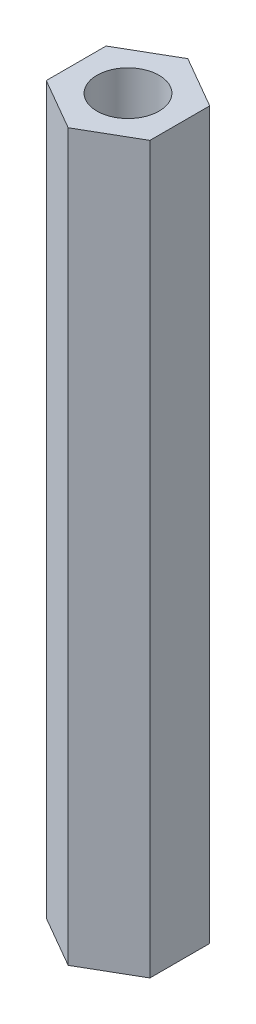
ISO-10303-21;
HEADER;
FILE_DESCRIPTION(('STEP AP214'),'2;1');
FILE_NAME('part.step','',(''),(''),'','','');
FILE_SCHEMA(('AUTOMOTIVE_DESIGN { 1 0 10303 214 1 1 1 1 }'));
ENDSEC;
DATA;
#1=APPLICATION_CONTEXT('core data for automotive mechanical design processes');
#2=APPLICATION_PROTOCOL_DEFINITION('international standard','automotive_design',2000,#1);
#3=PRODUCT_CONTEXT('',#1,'mechanical');
#4=PRODUCT('Part','Part','',(#3));
#5=PRODUCT_RELATED_PRODUCT_CATEGORY('part','',(#4));
#6=PRODUCT_DEFINITION_FORMATION('','',#4);
#7=PRODUCT_DEFINITION_CONTEXT('part definition',#1,'design');
#8=PRODUCT_DEFINITION('design','',#6,#7);
#9=PRODUCT_DEFINITION_SHAPE('','',#8);
#10=(LENGTH_UNIT() NAMED_UNIT(*) SI_UNIT(.MILLI.,.METRE.));
#11=(NAMED_UNIT(*) PLANE_ANGLE_UNIT() SI_UNIT($,.RADIAN.));
#12=(NAMED_UNIT(*) SI_UNIT($,.STERADIAN.) SOLID_ANGLE_UNIT());
#13=UNCERTAINTY_MEASURE_WITH_UNIT(LENGTH_MEASURE(1.E-05),#10,'distance_accuracy_value','');
#14=(GEOMETRIC_REPRESENTATION_CONTEXT(3) GLOBAL_UNCERTAINTY_ASSIGNED_CONTEXT((#13)) GLOBAL_UNIT_ASSIGNED_CONTEXT((#10,
#11,#12)) REPRESENTATION_CONTEXT('',''));
#15=CARTESIAN_POINT('',(0.,0.,0.));
#16=DIRECTION('',(0.,0.,1.));
#17=DIRECTION('',(1.,0.,0.));
#18=AXIS2_PLACEMENT_3D('',#15,#16,#17);
#19=CARTESIAN_POINT('',(0.,44.45,0.));
#20=DIRECTION('',(0.,1.,0.));
#21=DIRECTION('',(0.,0.,1.));
#22=AXIS2_PLACEMENT_3D('',#19,#20,#21);
#23=PLANE('',#22);
#24=DIRECTION('',(0.866025403784442,0.,0.499999999999995));
#25=VECTOR('',#24,1.);
#26=CARTESIAN_POINT('',(-3.17499999999998,44.45,1.8330871046771));
#27=LINE('',#26,#25);
#28=CARTESIAN_POINT('',(-3.17499999999998,44.45,1.8330871046771));
#29=VERTEX_POINT('',#28);
#30=CARTESIAN_POINT('',(0.,44.45,3.66617420935413));
#31=VERTEX_POINT('',#30);
#32=EDGE_CURVE('E129',#29,#31,#27,.T.);
#33=ORIENTED_EDGE('',*,*,#32,.T.);
#34=DIRECTION('',(0.866025403784438,0.,-0.500000000000001));
#35=VECTOR('',#34,1.);
#36=CARTESIAN_POINT('',(0.,44.45,3.66617420935413));
#37=LINE('',#36,#35);
#38=CARTESIAN_POINT('',(3.17500000000001,44.45,1.83308710467706));
#39=VERTEX_POINT('',#38);
#40=EDGE_CURVE('E87',#31,#39,#37,.T.);
#41=ORIENTED_EDGE('',*,*,#40,.T.);
#42=DIRECTION('',(0.,0.,-1.));
#43=VECTOR('',#42,1.);
#44=CARTESIAN_POINT('',(3.17500000000001,44.45,1.83308710467706));
#45=LINE('',#44,#43);
#46=CARTESIAN_POINT('',(3.17499999999999,44.45,-1.83308710467708));
#47=VERTEX_POINT('',#46);
#48=EDGE_CURVE('E100',#39,#47,#45,.T.);
#49=ORIENTED_EDGE('',*,*,#48,.T.);
#50=DIRECTION('',(-0.866025403784442,0.,-0.499999999999995));
#51=VECTOR('',#50,1.);
#52=CARTESIAN_POINT('',(3.17499999999999,44.45,-1.83308710467708));
#53=LINE('',#52,#51);
#54=CARTESIAN_POINT('',(0.,44.45,-3.66617420935413));
#55=VERTEX_POINT('',#54);
#56=EDGE_CURVE('E94',#47,#55,#53,.T.);
#57=ORIENTED_EDGE('',*,*,#56,.T.);
#58=DIRECTION('',(-0.866025403784435,0.,0.500000000000007));
#59=VECTOR('',#58,1.);
#60=CARTESIAN_POINT('',(0.,44.45,-3.66617420935413));
#61=LINE('',#60,#59);
#62=CARTESIAN_POINT('',(-3.17500000000002,44.45,-1.83308710467703));
#63=VERTEX_POINT('',#62);
#64=EDGE_CURVE('E98',#55,#63,#61,.T.);
#65=ORIENTED_EDGE('',*,*,#64,.T.);
#66=DIRECTION('',(0.,0.,1.));
#67=VECTOR('',#66,1.);
#68=CARTESIAN_POINT('',(-3.17500000000002,44.45,-1.83308710467703));
#69=LINE('',#68,#67);
#70=EDGE_CURVE('E50',#63,#29,#69,.T.);
#71=ORIENTED_EDGE('',*,*,#70,.T.);
#72=EDGE_LOOP('',(#33,#41,#49,#57,#65,#71));
#73=FACE_BOUND('',#72,.T.);
#74=CARTESIAN_POINT('',(0.,44.45,0.));
#75=DIRECTION('',(0.,1.,0.));
#76=DIRECTION('',(0.,0.,1.));
#77=AXIS2_PLACEMENT_3D('',#74,#75,#76);
#78=CIRCLE('',#77,1.905);
#79=CARTESIAN_POINT('',(0.,44.45,1.905));
#80=VERTEX_POINT('',#79);
#81=EDGE_CURVE('E122',#80,#80,#78,.T.);
#82=ORIENTED_EDGE('',*,*,#81,.F.);
#83=EDGE_LOOP('',(#82));
#84=FACE_BOUND('',#83,.T.);
#85=ADVANCED_FACE('F33',(#73,#84),#23,.T.);
#86=CARTESIAN_POINT('',(0.,0.,0.));
#87=DIRECTION('',(0.,1.,0.));
#88=DIRECTION('',(0.,0.,1.));
#89=AXIS2_PLACEMENT_3D('',#86,#87,#88);
#90=PLANE('',#89);
#91=DIRECTION('',(0.866025403784442,0.,0.499999999999995));
#92=VECTOR('',#91,1.);
#93=CARTESIAN_POINT('',(-3.17499999999998,0.,1.8330871046771));
#94=LINE('',#93,#92);
#95=CARTESIAN_POINT('',(-3.17499999999998,0.,1.8330871046771));
#96=VERTEX_POINT('',#95);
#97=CARTESIAN_POINT('',(0.,0.,3.66617420935413));
#98=VERTEX_POINT('',#97);
#99=EDGE_CURVE('E118',#96,#98,#94,.T.);
#100=ORIENTED_EDGE('',*,*,#99,.F.);
#101=DIRECTION('',(0.,0.,1.));
#102=VECTOR('',#101,1.);
#103=CARTESIAN_POINT('',(-3.17500000000002,0.,-1.83308710467703));
#104=LINE('',#103,#102);
#105=CARTESIAN_POINT('',(-3.17500000000002,0.,-1.83308710467703));
#106=VERTEX_POINT('',#105);
#107=EDGE_CURVE('E79',#106,#96,#104,.T.);
#108=ORIENTED_EDGE('',*,*,#107,.F.);
#109=DIRECTION('',(-0.866025403784435,0.,0.500000000000007));
#110=VECTOR('',#109,1.);
#111=CARTESIAN_POINT('',(0.,0.,-3.66617420935413));
#112=LINE('',#111,#110);
#113=CARTESIAN_POINT('',(0.,0.,-3.66617420935413));
#114=VERTEX_POINT('',#113);
#115=EDGE_CURVE('E73',#114,#106,#112,.T.);
#116=ORIENTED_EDGE('',*,*,#115,.F.);
#117=DIRECTION('',(-0.866025403784442,0.,-0.499999999999995));
#118=VECTOR('',#117,1.);
#119=CARTESIAN_POINT('',(3.17499999999999,0.,-1.83308710467708));
#120=LINE('',#119,#118);
#121=CARTESIAN_POINT('',(3.17499999999999,0.,-1.83308710467708));
#122=VERTEX_POINT('',#121);
#123=EDGE_CURVE('E108',#122,#114,#120,.T.);
#124=ORIENTED_EDGE('',*,*,#123,.F.);
#125=DIRECTION('',(0.,0.,-1.));
#126=VECTOR('',#125,1.);
#127=CARTESIAN_POINT('',(3.17500000000001,0.,1.83308710467706));
#128=LINE('',#127,#126);
#129=CARTESIAN_POINT('',(3.17500000000001,0.,1.83308710467706));
#130=VERTEX_POINT('',#129);
#131=EDGE_CURVE('E124',#130,#122,#128,.T.);
#132=ORIENTED_EDGE('',*,*,#131,.F.);
#133=DIRECTION('',(0.866025403784438,0.,-0.500000000000001));
#134=VECTOR('',#133,1.);
#135=CARTESIAN_POINT('',(0.,0.,3.66617420935413));
#136=LINE('',#135,#134);
#137=EDGE_CURVE('E121',#98,#130,#136,.T.);
#138=ORIENTED_EDGE('',*,*,#137,.F.);
#139=EDGE_LOOP('',(#100,#108,#116,#124,#132,#138));
#140=FACE_BOUND('',#139,.T.);
#141=CARTESIAN_POINT('',(0.,0.,0.));
#142=DIRECTION('',(0.,1.,0.));
#143=DIRECTION('',(0.,0.,1.));
#144=AXIS2_PLACEMENT_3D('',#141,#142,#143);
#145=CIRCLE('',#144,1.905);
#146=CARTESIAN_POINT('',(0.,0.,1.905));
#147=VERTEX_POINT('',#146);
#148=EDGE_CURVE('E222',#147,#147,#145,.T.);
#149=ORIENTED_EDGE('',*,*,#148,.T.);
#150=EDGE_LOOP('',(#149));
#151=FACE_BOUND('',#150,.T.);
#152=ADVANCED_FACE('F138',(#140,#151),#90,.F.);
#153=CARTESIAN_POINT('',(-3.17499999999998,44.45,1.8330871046771));
#154=DIRECTION('',(0.499999999999995,0.,-0.866025403784441));
#155=DIRECTION('',(-0.866025403784442,0.,-0.499999999999995));
#156=AXIS2_PLACEMENT_3D('',#153,#154,#155);
#157=PLANE('',#156);
#158=ORIENTED_EDGE('',*,*,#99,.T.);
#159=DIRECTION('',(0.,-1.,0.));
#160=VECTOR('',#159,1.);
#161=CARTESIAN_POINT('',(0.,44.45,3.66617420935413));
#162=LINE('',#161,#160);
#163=EDGE_CURVE('E11',#31,#98,#162,.T.);
#164=ORIENTED_EDGE('',*,*,#163,.F.);
#165=ORIENTED_EDGE('',*,*,#32,.F.);
#166=DIRECTION('',(0.,-1.,0.));
#167=VECTOR('',#166,1.);
#168=CARTESIAN_POINT('',(-3.17499999999998,44.45,1.8330871046771));
#169=LINE('',#168,#167);
#170=EDGE_CURVE('E114',#29,#96,#169,.T.);
#171=ORIENTED_EDGE('',*,*,#170,.T.);
#172=EDGE_LOOP('',(#158,#164,#165,#171));
#173=FACE_BOUND('',#172,.T.);
#174=ADVANCED_FACE('F35',(#173),#157,.F.);
#175=CARTESIAN_POINT('',(0.,44.45,3.66617420935413));
#176=DIRECTION('',(-0.500000000000001,0.,-0.866025403784438));
#177=DIRECTION('',(-0.866025403784438,0.,0.500000000000001));
#178=AXIS2_PLACEMENT_3D('',#175,#176,#177);
#179=PLANE('',#178);
#180=ORIENTED_EDGE('',*,*,#137,.T.);
#181=DIRECTION('',(0.,-1.,0.));
#182=VECTOR('',#181,1.);
#183=CARTESIAN_POINT('',(3.17500000000001,44.45,1.83308710467706));
#184=LINE('',#183,#182);
#185=EDGE_CURVE('E42',#39,#130,#184,.T.);
#186=ORIENTED_EDGE('',*,*,#185,.F.);
#187=ORIENTED_EDGE('',*,*,#40,.F.);
#188=ORIENTED_EDGE('',*,*,#163,.T.);
#189=EDGE_LOOP('',(#180,#186,#187,#188));
#190=FACE_BOUND('',#189,.T.);
#191=ADVANCED_FACE('F163',(#190),#179,.F.);
#192=CARTESIAN_POINT('',(3.17500000000001,44.45,1.83308710467706));
#193=DIRECTION('',(-1.,0.,0.));
#194=DIRECTION('',(0.,0.,1.));
#195=AXIS2_PLACEMENT_3D('',#192,#193,#194);
#196=PLANE('',#195);
#197=ORIENTED_EDGE('',*,*,#131,.T.);
#198=DIRECTION('',(0.,-1.,0.));
#199=VECTOR('',#198,1.);
#200=CARTESIAN_POINT('',(3.17499999999999,44.45,-1.83308710467708));
#201=LINE('',#200,#199);
#202=EDGE_CURVE('E109',#47,#122,#201,.T.);
#203=ORIENTED_EDGE('',*,*,#202,.F.);
#204=ORIENTED_EDGE('',*,*,#48,.F.);
#205=ORIENTED_EDGE('',*,*,#185,.T.);
#206=EDGE_LOOP('',(#197,#203,#204,#205));
#207=FACE_BOUND('',#206,.T.);
#208=ADVANCED_FACE('F135',(#207),#196,.F.);
#209=CARTESIAN_POINT('',(3.17499999999999,44.45,-1.83308710467708));
#210=DIRECTION('',(-0.499999999999995,0.,0.866025403784441));
#211=DIRECTION('',(0.866025403784442,0.,0.499999999999995));
#212=AXIS2_PLACEMENT_3D('',#209,#210,#211);
#213=PLANE('',#212);
#214=ORIENTED_EDGE('',*,*,#123,.T.);
#215=DIRECTION('',(0.,-1.,0.));
#216=VECTOR('',#215,1.);
#217=CARTESIAN_POINT('',(0.,44.45,-3.66617420935413));
#218=LINE('',#217,#216);
#219=EDGE_CURVE('E105',#55,#114,#218,.T.);
#220=ORIENTED_EDGE('',*,*,#219,.F.);
#221=ORIENTED_EDGE('',*,*,#56,.F.);
#222=ORIENTED_EDGE('',*,*,#202,.T.);
#223=EDGE_LOOP('',(#214,#220,#221,#222));
#224=FACE_BOUND('',#223,.T.);
#225=ADVANCED_FACE('F106',(#224),#213,.F.);
#226=CARTESIAN_POINT('',(0.,44.45,-3.66617420935413));
#227=DIRECTION('',(0.500000000000007,0.,0.866025403784435));
#228=DIRECTION('',(0.866025403784435,0.,-0.500000000000007));
#229=AXIS2_PLACEMENT_3D('',#226,#227,#228);
#230=PLANE('',#229);
#231=ORIENTED_EDGE('',*,*,#115,.T.);
#232=DIRECTION('',(0.,-1.,0.));
#233=VECTOR('',#232,1.);
#234=CARTESIAN_POINT('',(-3.17500000000002,44.45,-1.83308710467703));
#235=LINE('',#234,#233);
#236=EDGE_CURVE('E110',#63,#106,#235,.T.);
#237=ORIENTED_EDGE('',*,*,#236,.F.);
#238=ORIENTED_EDGE('',*,*,#64,.F.);
#239=ORIENTED_EDGE('',*,*,#219,.T.);
#240=EDGE_LOOP('',(#231,#237,#238,#239));
#241=FACE_BOUND('',#240,.T.);
#242=ADVANCED_FACE('F112',(#241),#230,.F.);
#243=CARTESIAN_POINT('',(-3.17500000000002,44.45,-1.83308710467703));
#244=DIRECTION('',(1.,0.,0.));
#245=DIRECTION('',(0.,0.,-1.));
#246=AXIS2_PLACEMENT_3D('',#243,#244,#245);
#247=PLANE('',#246);
#248=ORIENTED_EDGE('',*,*,#107,.T.);
#249=ORIENTED_EDGE('',*,*,#170,.F.);
#250=ORIENTED_EDGE('',*,*,#70,.F.);
#251=ORIENTED_EDGE('',*,*,#236,.T.);
#252=EDGE_LOOP('',(#248,#249,#250,#251));
#253=FACE_BOUND('',#252,.T.);
#254=ADVANCED_FACE('F143',(#253),#247,.F.);
#255=CARTESIAN_POINT('',(0.,44.45,0.));
#256=DIRECTION('',(0.,-1.,0.));
#257=DIRECTION('',(0.,0.,-1.));
#258=AXIS2_PLACEMENT_3D('',#255,#256,#257);
#259=CYLINDRICAL_SURFACE('',#258,1.905);
#260=ORIENTED_EDGE('',*,*,#81,.T.);
#261=EDGE_LOOP('',(#260));
#262=FACE_BOUND('',#261,.T.);
#263=ORIENTED_EDGE('',*,*,#148,.F.);
#264=EDGE_LOOP('',(#263));
#265=FACE_BOUND('',#264,.T.);
#266=ADVANCED_FACE('F145',(#262,#265),#259,.F.);
#267=CLOSED_SHELL('',(#85,#152,#174,#191,#208,#225,#242,#254,#266));
#268=MANIFOLD_SOLID_BREP('B2',#267);
#269=ADVANCED_BREP_SHAPE_REPRESENTATION('',(#18,#268),#14);
#270=SHAPE_DEFINITION_REPRESENTATION(#9,#269);
ENDSEC;
END-ISO-10303-21;
